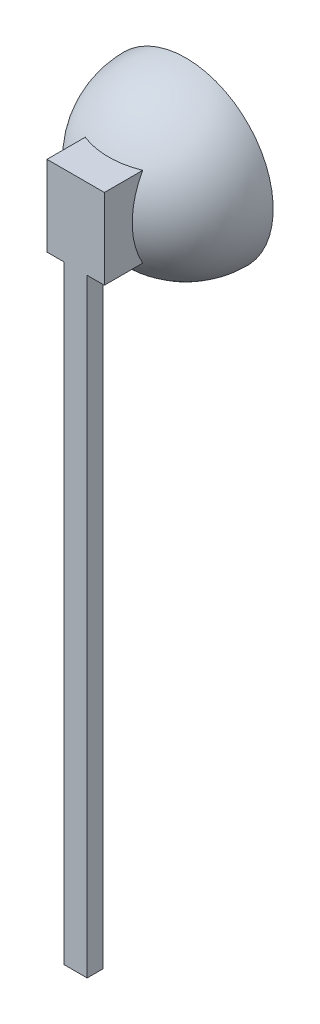
ISO-10303-21;
HEADER;
FILE_DESCRIPTION(('STEP AP214'),'2;1');
FILE_NAME('part.step','',(''),(''),'','','');
FILE_SCHEMA(('AUTOMOTIVE_DESIGN { 1 0 10303 214 1 1 1 1 }'));
ENDSEC;
DATA;
#1=APPLICATION_CONTEXT('core data for automotive mechanical design processes');
#2=APPLICATION_PROTOCOL_DEFINITION('international standard','automotive_design',2000,#1);
#3=PRODUCT_CONTEXT('',#1,'mechanical');
#4=PRODUCT('Part','Part','',(#3));
#5=PRODUCT_RELATED_PRODUCT_CATEGORY('part','',(#4));
#6=PRODUCT_DEFINITION_FORMATION('','',#4);
#7=PRODUCT_DEFINITION_CONTEXT('part definition',#1,'design');
#8=PRODUCT_DEFINITION('design','',#6,#7);
#9=PRODUCT_DEFINITION_SHAPE('','',#8);
#10=(LENGTH_UNIT() NAMED_UNIT(*) SI_UNIT(.MILLI.,.METRE.));
#11=(NAMED_UNIT(*) PLANE_ANGLE_UNIT() SI_UNIT($,.RADIAN.));
#12=(NAMED_UNIT(*) SI_UNIT($,.STERADIAN.) SOLID_ANGLE_UNIT());
#13=UNCERTAINTY_MEASURE_WITH_UNIT(LENGTH_MEASURE(1.E-05),#10,'distance_accuracy_value','');
#14=(GEOMETRIC_REPRESENTATION_CONTEXT(3) GLOBAL_UNCERTAINTY_ASSIGNED_CONTEXT((#13)) GLOBAL_UNIT_ASSIGNED_CONTEXT((#10,
#11,#12)) REPRESENTATION_CONTEXT('',''));
#15=CARTESIAN_POINT('',(0.,0.,0.));
#16=DIRECTION('',(0.,0.,1.));
#17=DIRECTION('',(1.,0.,0.));
#18=AXIS2_PLACEMENT_3D('',#15,#16,#17);
#19=CARTESIAN_POINT('',(0.,0.,0.));
#20=DIRECTION('',(0.,1.,0.));
#21=DIRECTION('',(1.,0.,0.));
#22=AXIS2_PLACEMENT_3D('',#19,#20,#21);
#23=SPHERICAL_SURFACE('',#22,33.);
#24=CARTESIAN_POINT('',(0.,0.,0.));
#25=DIRECTION('',(0.,0.,1.));
#26=DIRECTION('',(-1.,0.,0.));
#27=AXIS2_PLACEMENT_3D('',#24,#25,#26);
#28=SPHERICAL_SURFACE('',#27,33.);
#29=CARTESIAN_POINT('',(0.,0.,0.));
#30=DIRECTION('',(0.,0.,1.));
#31=DIRECTION('',(-1.,0.,0.));
#32=AXIS2_PLACEMENT_3D('',#29,#30,#31);
#33=CIRCLE('',#32,33.);
#34=CARTESIAN_POINT('',(-33.,0.,-2.30437768363647E-13));
#35=VERTEX_POINT('',#34);
#36=EDGE_CURVE('E46',#35,#35,#33,.T.);
#37=ORIENTED_EDGE('',*,*,#36,.F.);
#38=EDGE_LOOP('',(#37));
#39=FACE_BOUND('',#38,.T.);
#40=ADVANCED_FACE('F38',(#39),#28,.F.);
#41=CARTESIAN_POINT('',(0.,0.,0.));
#42=DIRECTION('',(0.,1.,0.));
#43=DIRECTION('',(1.,0.,0.));
#44=AXIS2_PLACEMENT_3D('',#41,#42,#43);
#45=SPHERICAL_SURFACE('',#44,38.);
#46=CARTESIAN_POINT('',(0.,-17.5,0.));
#47=DIRECTION('',(0.,1.,0.));
#48=DIRECTION('',(0.,0.,1.));
#49=AXIS2_PLACEMENT_3D('',#46,#47,#48);
#50=CIRCLE('',#49,33.7305499510459);
#51=CARTESIAN_POINT('',(12.4999999999998,-17.5,31.3289003956412));
#52=VERTEX_POINT('',#51);
#53=CARTESIAN_POINT('',(-12.5000000000002,-17.5,31.328900395641));
#54=VERTEX_POINT('',#53);
#55=EDGE_CURVE('E194',#52,#54,#50,.F.);
#56=ORIENTED_EDGE('',*,*,#55,.T.);
#57=CARTESIAN_POINT('',(-12.5,0.,0.));
#58=DIRECTION('',(1.,0.,0.));
#59=DIRECTION('',(0.,0.,-1.));
#60=AXIS2_PLACEMENT_3D('',#57,#58,#59);
#61=CIRCLE('',#60,35.8852337319962);
#62=CARTESIAN_POINT('',(-12.5000000000002,17.5,31.328900395641));
#63=VERTEX_POINT('',#62);
#64=EDGE_CURVE('E193',#54,#63,#61,.F.);
#65=ORIENTED_EDGE('',*,*,#64,.T.);
#66=CARTESIAN_POINT('',(0.,17.5,0.));
#67=DIRECTION('',(0.,-1.,0.));
#68=DIRECTION('',(0.,0.,-1.));
#69=AXIS2_PLACEMENT_3D('',#66,#67,#68);
#70=CIRCLE('',#69,33.7305499510459);
#71=CARTESIAN_POINT('',(12.4999999999998,17.5,31.3289003956412));
#72=VERTEX_POINT('',#71);
#73=EDGE_CURVE('E201',#63,#72,#70,.F.);
#74=ORIENTED_EDGE('',*,*,#73,.T.);
#75=CARTESIAN_POINT('',(12.5,0.,0.));
#76=DIRECTION('',(-1.,0.,0.));
#77=DIRECTION('',(0.,0.,1.));
#78=AXIS2_PLACEMENT_3D('',#75,#76,#77);
#79=CIRCLE('',#78,35.8852337319962);
#80=EDGE_CURVE('E198',#72,#52,#79,.F.);
#81=ORIENTED_EDGE('',*,*,#80,.T.);
#82=EDGE_LOOP('',(#56,#65,#74,#81));
#83=FACE_BOUND('',#82,.T.);
#84=CARTESIAN_POINT('',(0.,0.,0.));
#85=DIRECTION('',(0.,0.,-1.));
#86=DIRECTION('',(-1.,0.,0.));
#87=AXIS2_PLACEMENT_3D('',#84,#85,#86);
#88=CIRCLE('',#87,38.);
#89=CARTESIAN_POINT('',(-38.,0.,-2.65352581752078E-13));
#90=VERTEX_POINT('',#89);
#91=EDGE_CURVE('E11',#90,#90,#88,.T.);
#92=ORIENTED_EDGE('',*,*,#91,.F.);
#93=EDGE_LOOP('',(#92));
#94=FACE_BOUND('',#93,.T.);
#95=ADVANCED_FACE('F40',(#83,#94),#45,.T.);
#96=CARTESIAN_POINT('',(0.,0.,0.));
#97=DIRECTION('',(0.,0.,-1.));
#98=DIRECTION('',(-1.,0.,0.));
#99=AXIS2_PLACEMENT_3D('',#96,#97,#98);
#100=PLANE('',#99);
#101=ORIENTED_EDGE('',*,*,#91,.T.);
#102=EDGE_LOOP('',(#101));
#103=FACE_BOUND('',#102,.T.);
#104=ORIENTED_EDGE('',*,*,#36,.T.);
#105=EDGE_LOOP('',(#104));
#106=FACE_BOUND('',#105,.T.);
#107=ADVANCED_FACE('F227',(#103,#106),#100,.T.);
#108=CARTESIAN_POINT('',(-12.5000000000003,-17.5,47.9999999999999));
#109=DIRECTION('',(-1.,0.,0.));
#110=DIRECTION('',(0.,0.,1.));
#111=AXIS2_PLACEMENT_3D('',#108,#109,#110);
#112=PLANE('',#111);
#113=DIRECTION('',(0.,0.,-1.));
#114=VECTOR('',#113,1.);
#115=CARTESIAN_POINT('',(-12.5000000000003,17.5,47.9999999999999));
#116=LINE('',#115,#114);
#117=CARTESIAN_POINT('',(-12.5000000000003,17.5,47.9999999999999));
#118=VERTEX_POINT('',#117);
#119=EDGE_CURVE('E216',#118,#63,#116,.T.);
#120=ORIENTED_EDGE('',*,*,#119,.T.);
#121=ORIENTED_EDGE('',*,*,#64,.F.);
#122=DIRECTION('',(0.,0.,-1.));
#123=VECTOR('',#122,1.);
#124=CARTESIAN_POINT('',(-12.5000000000003,-17.5,47.9999999999999));
#125=LINE('',#124,#123);
#126=CARTESIAN_POINT('',(-12.5000000000003,-17.5,47.9999999999999));
#127=VERTEX_POINT('',#126);
#128=EDGE_CURVE('E217',#127,#54,#125,.T.);
#129=ORIENTED_EDGE('',*,*,#128,.F.);
#130=DIRECTION('',(0.,1.,0.));
#131=VECTOR('',#130,1.);
#132=CARTESIAN_POINT('',(-12.5000000000003,-17.5,47.9999999999999));
#133=LINE('',#132,#131);
#134=EDGE_CURVE('E197',#127,#118,#133,.T.);
#135=ORIENTED_EDGE('',*,*,#134,.T.);
#136=EDGE_LOOP('',(#120,#121,#129,#135));
#137=FACE_BOUND('',#136,.T.);
#138=ADVANCED_FACE('F237',(#137),#112,.T.);
#139=CARTESIAN_POINT('',(12.4999999999997,-17.5,48.0000000000001));
#140=DIRECTION('',(0.,-1.,0.));
#141=DIRECTION('',(0.,0.,-1.));
#142=AXIS2_PLACEMENT_3D('',#139,#140,#141);
#143=PLANE('',#142);
#144=DIRECTION('',(0.,0.,-1.));
#145=VECTOR('',#144,1.);
#146=CARTESIAN_POINT('',(-5.00000000000034,-17.5,48.0000000000001));
#147=LINE('',#146,#145);
#148=CARTESIAN_POINT('',(-5.00000000000034,-17.5,48.));
#149=VERTEX_POINT('',#148);
#150=CARTESIAN_POINT('',(-5.00000000000034,-17.5,41.));
#151=VERTEX_POINT('',#150);
#152=EDGE_CURVE('E190',#149,#151,#147,.T.);
#153=ORIENTED_EDGE('',*,*,#152,.F.);
#154=DIRECTION('',(-1.,0.,0.));
#155=VECTOR('',#154,1.);
#156=CARTESIAN_POINT('',(12.4999999999997,-17.5,48.0000000000001));
#157=LINE('',#156,#155);
#158=EDGE_CURVE('E213',#149,#127,#157,.T.);
#159=ORIENTED_EDGE('',*,*,#158,.T.);
#160=ORIENTED_EDGE('',*,*,#128,.T.);
#161=ORIENTED_EDGE('',*,*,#55,.F.);
#162=DIRECTION('',(0.,0.,-1.));
#163=VECTOR('',#162,1.);
#164=CARTESIAN_POINT('',(12.4999999999997,-17.5,48.0000000000001));
#165=LINE('',#164,#163);
#166=CARTESIAN_POINT('',(12.4999999999997,-17.5,48.0000000000001));
#167=VERTEX_POINT('',#166);
#168=EDGE_CURVE('E219',#167,#52,#165,.T.);
#169=ORIENTED_EDGE('',*,*,#168,.F.);
#170=CARTESIAN_POINT('',(4.99999999999966,-17.5,48.));
#171=VERTEX_POINT('',#170);
#172=EDGE_CURVE('E214',#167,#171,#157,.T.);
#173=ORIENTED_EDGE('',*,*,#172,.T.);
#174=DIRECTION('',(0.,0.,1.));
#175=VECTOR('',#174,1.);
#176=CARTESIAN_POINT('',(4.99999999999966,-17.5,48.0000000000001));
#177=LINE('',#176,#175);
#178=CARTESIAN_POINT('',(4.99999999999969,-17.5,41.));
#179=VERTEX_POINT('',#178);
#180=EDGE_CURVE('E185',#179,#171,#177,.T.);
#181=ORIENTED_EDGE('',*,*,#180,.F.);
#182=DIRECTION('',(-1.,0.,0.));
#183=VECTOR('',#182,1.);
#184=CARTESIAN_POINT('',(12.4999999999997,-17.5,41.));
#185=LINE('',#184,#183);
#186=EDGE_CURVE('E61',#179,#151,#185,.T.);
#187=ORIENTED_EDGE('',*,*,#186,.T.);
#188=EDGE_LOOP('',(#153,#159,#160,#161,#169,#173,#181,#187));
#189=FACE_BOUND('',#188,.T.);
#190=ADVANCED_FACE('F241',(#189),#143,.T.);
#191=CARTESIAN_POINT('',(12.4999999999997,-17.5,48.0000000000001));
#192=DIRECTION('',(1.,0.,0.));
#193=DIRECTION('',(0.,0.,-1.));
#194=AXIS2_PLACEMENT_3D('',#191,#192,#193);
#195=PLANE('',#194);
#196=ORIENTED_EDGE('',*,*,#168,.T.);
#197=ORIENTED_EDGE('',*,*,#80,.F.);
#198=DIRECTION('',(0.,0.,-1.));
#199=VECTOR('',#198,1.);
#200=CARTESIAN_POINT('',(12.4999999999997,17.5,48.0000000000001));
#201=LINE('',#200,#199);
#202=CARTESIAN_POINT('',(12.4999999999997,17.5,48.0000000000001));
#203=VERTEX_POINT('',#202);
#204=EDGE_CURVE('E221',#203,#72,#201,.T.);
#205=ORIENTED_EDGE('',*,*,#204,.F.);
#206=DIRECTION('',(0.,-1.,0.));
#207=VECTOR('',#206,1.);
#208=CARTESIAN_POINT('',(12.4999999999997,-17.5,48.0000000000001));
#209=LINE('',#208,#207);
#210=EDGE_CURVE('E210',#203,#167,#209,.T.);
#211=ORIENTED_EDGE('',*,*,#210,.T.);
#212=EDGE_LOOP('',(#196,#197,#205,#211));
#213=FACE_BOUND('',#212,.T.);
#214=ADVANCED_FACE('F247',(#213),#195,.T.);
#215=CARTESIAN_POINT('',(12.4999999999997,17.5,48.0000000000001));
#216=DIRECTION('',(0.,1.,0.));
#217=DIRECTION('',(0.,0.,1.));
#218=AXIS2_PLACEMENT_3D('',#215,#216,#217);
#219=PLANE('',#218);
#220=DIRECTION('',(1.,0.,0.));
#221=VECTOR('',#220,1.);
#222=CARTESIAN_POINT('',(12.4999999999997,17.5,48.0000000000001));
#223=LINE('',#222,#221);
#224=EDGE_CURVE('E208',#118,#203,#223,.T.);
#225=ORIENTED_EDGE('',*,*,#224,.T.);
#226=ORIENTED_EDGE('',*,*,#204,.T.);
#227=ORIENTED_EDGE('',*,*,#73,.F.);
#228=ORIENTED_EDGE('',*,*,#119,.F.);
#229=EDGE_LOOP('',(#225,#226,#227,#228));
#230=FACE_BOUND('',#229,.T.);
#231=ADVANCED_FACE('F243',(#230),#219,.T.);
#232=CARTESIAN_POINT('',(-3.44054713859276E-13,0.,48.));
#233=DIRECTION('',(0.,0.,1.));
#234=DIRECTION('',(1.,0.,0.));
#235=AXIS2_PLACEMENT_3D('',#232,#233,#234);
#236=PLANE('',#235);
#237=ORIENTED_EDGE('',*,*,#210,.F.);
#238=ORIENTED_EDGE('',*,*,#224,.F.);
#239=ORIENTED_EDGE('',*,*,#134,.F.);
#240=ORIENTED_EDGE('',*,*,#158,.F.);
#241=DIRECTION('',(0.,-1.,0.));
#242=VECTOR('',#241,1.);
#243=CARTESIAN_POINT('',(-5.00000000000035,17.5,48.));
#244=LINE('',#243,#242);
#245=CARTESIAN_POINT('',(-5.00000000000031,-282.5,48.));
#246=VERTEX_POINT('',#245);
#247=EDGE_CURVE('E163',#149,#246,#244,.T.);
#248=ORIENTED_EDGE('',*,*,#247,.T.);
#249=DIRECTION('',(1.,0.,0.));
#250=VECTOR('',#249,1.);
#251=CARTESIAN_POINT('',(-5.00000000000031,-282.5,48.));
#252=LINE('',#251,#250);
#253=CARTESIAN_POINT('',(4.99999999999969,-282.5,48.));
#254=VERTEX_POINT('',#253);
#255=EDGE_CURVE('E178',#246,#254,#252,.T.);
#256=ORIENTED_EDGE('',*,*,#255,.T.);
#257=DIRECTION('',(0.,1.,0.));
#258=VECTOR('',#257,1.);
#259=CARTESIAN_POINT('',(4.99999999999965,17.5,48.));
#260=LINE('',#259,#258);
#261=EDGE_CURVE('E170',#254,#171,#260,.T.);
#262=ORIENTED_EDGE('',*,*,#261,.T.);
#263=ORIENTED_EDGE('',*,*,#172,.F.);
#264=EDGE_LOOP('',(#237,#238,#239,#240,#248,#256,#262,#263));
#265=FACE_BOUND('',#264,.T.);
#266=ADVANCED_FACE('F246',(#265),#236,.T.);
#267=CARTESIAN_POINT('',(-5.00000000000035,17.5,41.));
#268=DIRECTION('',(-1.,0.,0.));
#269=DIRECTION('',(0.,-1.,0.));
#270=AXIS2_PLACEMENT_3D('',#267,#268,#269);
#271=PLANE('',#270);
#272=ORIENTED_EDGE('',*,*,#247,.F.);
#273=ORIENTED_EDGE('',*,*,#152,.T.);
#274=DIRECTION('',(0.,-1.,0.));
#275=VECTOR('',#274,1.);
#276=CARTESIAN_POINT('',(-5.00000000000035,17.5,41.));
#277=LINE('',#276,#275);
#278=CARTESIAN_POINT('',(-5.00000000000031,-282.5,41.));
#279=VERTEX_POINT('',#278);
#280=EDGE_CURVE('E167',#151,#279,#277,.T.);
#281=ORIENTED_EDGE('',*,*,#280,.T.);
#282=DIRECTION('',(0.,0.,1.));
#283=VECTOR('',#282,1.);
#284=CARTESIAN_POINT('',(-5.00000000000031,-282.5,41.));
#285=LINE('',#284,#283);
#286=EDGE_CURVE('E176',#279,#246,#285,.T.);
#287=ORIENTED_EDGE('',*,*,#286,.T.);
#288=EDGE_LOOP('',(#272,#273,#281,#287));
#289=FACE_BOUND('',#288,.T.);
#290=ADVANCED_FACE('F256',(#289),#271,.T.);
#291=CARTESIAN_POINT('',(4.99999999999965,17.5,41.));
#292=DIRECTION('',(1.,0.,0.));
#293=DIRECTION('',(0.,1.,0.));
#294=AXIS2_PLACEMENT_3D('',#291,#292,#293);
#295=PLANE('',#294);
#296=DIRECTION('',(0.,1.,0.));
#297=VECTOR('',#296,1.);
#298=CARTESIAN_POINT('',(4.99999999999965,17.5,41.));
#299=LINE('',#298,#297);
#300=CARTESIAN_POINT('',(4.99999999999969,-282.5,41.));
#301=VERTEX_POINT('',#300);
#302=EDGE_CURVE('E173',#301,#179,#299,.T.);
#303=ORIENTED_EDGE('',*,*,#302,.T.);
#304=ORIENTED_EDGE('',*,*,#180,.T.);
#305=ORIENTED_EDGE('',*,*,#261,.F.);
#306=DIRECTION('',(0.,0.,1.));
#307=VECTOR('',#306,1.);
#308=CARTESIAN_POINT('',(4.99999999999969,-282.5,41.));
#309=LINE('',#308,#307);
#310=EDGE_CURVE('E183',#301,#254,#309,.T.);
#311=ORIENTED_EDGE('',*,*,#310,.F.);
#312=EDGE_LOOP('',(#303,#304,#305,#311));
#313=FACE_BOUND('',#312,.T.);
#314=ADVANCED_FACE('F260',(#313),#295,.T.);
#315=CARTESIAN_POINT('',(-5.00000000000031,-282.5,41.));
#316=DIRECTION('',(0.,-1.,0.));
#317=DIRECTION('',(0.,0.,-1.));
#318=AXIS2_PLACEMENT_3D('',#315,#316,#317);
#319=PLANE('',#318);
#320=DIRECTION('',(0.,0.,1.));
#321=VECTOR('',#320,1.);
#322=CARTESIAN_POINT('',(3.49999999999969,-282.5,42.25));
#323=LINE('',#322,#321);
#324=CARTESIAN_POINT('',(3.49999999999969,-282.5,42.25));
#325=VERTEX_POINT('',#324);
#326=CARTESIAN_POINT('',(3.49999999999969,-282.5,46.75));
#327=VERTEX_POINT('',#326);
#328=EDGE_CURVE('E53',#325,#327,#323,.T.);
#329=ORIENTED_EDGE('',*,*,#328,.F.);
#330=DIRECTION('',(1.,0.,0.));
#331=VECTOR('',#330,1.);
#332=CARTESIAN_POINT('',(3.49999999999969,-282.5,42.25));
#333=LINE('',#332,#331);
#334=CARTESIAN_POINT('',(-3.50000000000031,-282.5,42.25));
#335=VERTEX_POINT('',#334);
#336=EDGE_CURVE('E148',#335,#325,#333,.T.);
#337=ORIENTED_EDGE('',*,*,#336,.F.);
#338=DIRECTION('',(0.,0.,-1.));
#339=VECTOR('',#338,1.);
#340=CARTESIAN_POINT('',(-3.50000000000031,-282.5,42.25));
#341=LINE('',#340,#339);
#342=CARTESIAN_POINT('',(-3.50000000000031,-282.5,46.75));
#343=VERTEX_POINT('',#342);
#344=EDGE_CURVE('E151',#343,#335,#341,.T.);
#345=ORIENTED_EDGE('',*,*,#344,.F.);
#346=DIRECTION('',(-1.,0.,0.));
#347=VECTOR('',#346,1.);
#348=CARTESIAN_POINT('',(3.49999999999969,-282.5,46.75));
#349=LINE('',#348,#347);
#350=EDGE_CURVE('E157',#327,#343,#349,.T.);
#351=ORIENTED_EDGE('',*,*,#350,.F.);
#352=EDGE_LOOP('',(#329,#337,#345,#351));
#353=FACE_BOUND('',#352,.T.);
#354=ORIENTED_EDGE('',*,*,#255,.F.);
#355=ORIENTED_EDGE('',*,*,#286,.F.);
#356=DIRECTION('',(1.,0.,0.));
#357=VECTOR('',#356,1.);
#358=CARTESIAN_POINT('',(-5.00000000000031,-282.5,41.));
#359=LINE('',#358,#357);
#360=EDGE_CURVE('E169',#279,#301,#359,.T.);
#361=ORIENTED_EDGE('',*,*,#360,.T.);
#362=ORIENTED_EDGE('',*,*,#310,.T.);
#363=EDGE_LOOP('',(#354,#355,#361,#362));
#364=FACE_BOUND('',#363,.T.);
#365=ADVANCED_FACE('F262',(#353,#364),#319,.T.);
#366=CARTESIAN_POINT('',(0.,0.,41.));
#367=DIRECTION('',(0.,0.,1.));
#368=DIRECTION('',(1.,0.,0.));
#369=AXIS2_PLACEMENT_3D('',#366,#367,#368);
#370=PLANE('',#369);
#371=ORIENTED_EDGE('',*,*,#186,.F.);
#372=ORIENTED_EDGE('',*,*,#302,.F.);
#373=ORIENTED_EDGE('',*,*,#360,.F.);
#374=ORIENTED_EDGE('',*,*,#280,.F.);
#375=EDGE_LOOP('',(#371,#372,#373,#374));
#376=FACE_BOUND('',#375,.T.);
#377=ADVANCED_FACE('F265',(#376),#370,.F.);
#378=CARTESIAN_POINT('',(3.49999999999969,-17.5,42.25));
#379=DIRECTION('',(1.,0.,0.));
#380=DIRECTION('',(0.,0.,-1.));
#381=AXIS2_PLACEMENT_3D('',#378,#379,#380);
#382=PLANE('',#381);
#383=ORIENTED_EDGE('',*,*,#328,.T.);
#384=DIRECTION('',(0.,-1.,0.));
#385=VECTOR('',#384,1.);
#386=CARTESIAN_POINT('',(3.49999999999969,-17.5,46.75));
#387=LINE('',#386,#385);
#388=CARTESIAN_POINT('',(3.49999999999969,-17.5,46.75));
#389=VERTEX_POINT('',#388);
#390=EDGE_CURVE('E126',#389,#327,#387,.T.);
#391=ORIENTED_EDGE('',*,*,#390,.F.);
#392=DIRECTION('',(0.,0.,1.));
#393=VECTOR('',#392,1.);
#394=CARTESIAN_POINT('',(3.49999999999969,-17.5,42.25));
#395=LINE('',#394,#393);
#396=CARTESIAN_POINT('',(3.49999999999969,-17.5,42.25));
#397=VERTEX_POINT('',#396);
#398=EDGE_CURVE('E130',#397,#389,#395,.T.);
#399=ORIENTED_EDGE('',*,*,#398,.F.);
#400=DIRECTION('',(0.,-1.,0.));
#401=VECTOR('',#400,1.);
#402=CARTESIAN_POINT('',(3.49999999999969,-17.5,42.25));
#403=LINE('',#402,#401);
#404=EDGE_CURVE('E161',#397,#325,#403,.T.);
#405=ORIENTED_EDGE('',*,*,#404,.T.);
#406=EDGE_LOOP('',(#383,#391,#399,#405));
#407=FACE_BOUND('',#406,.T.);
#408=ADVANCED_FACE('F128',(#407),#382,.F.);
#409=CARTESIAN_POINT('',(3.49999999999969,-17.5,42.25));
#410=DIRECTION('',(0.,0.,-1.));
#411=DIRECTION('',(-1.,0.,0.));
#412=AXIS2_PLACEMENT_3D('',#409,#410,#411);
#413=PLANE('',#412);
#414=ORIENTED_EDGE('',*,*,#336,.T.);
#415=ORIENTED_EDGE('',*,*,#404,.F.);
#416=DIRECTION('',(1.,0.,0.));
#417=VECTOR('',#416,1.);
#418=CARTESIAN_POINT('',(3.49999999999969,-17.5,42.25));
#419=LINE('',#418,#417);
#420=CARTESIAN_POINT('',(-3.50000000000031,-17.5,42.25));
#421=VERTEX_POINT('',#420);
#422=EDGE_CURVE('E136',#421,#397,#419,.T.);
#423=ORIENTED_EDGE('',*,*,#422,.F.);
#424=DIRECTION('',(0.,-1.,0.));
#425=VECTOR('',#424,1.);
#426=CARTESIAN_POINT('',(-3.50000000000031,-17.5,42.25));
#427=LINE('',#426,#425);
#428=EDGE_CURVE('E164',#421,#335,#427,.T.);
#429=ORIENTED_EDGE('',*,*,#428,.T.);
#430=EDGE_LOOP('',(#414,#415,#423,#429));
#431=FACE_BOUND('',#430,.T.);
#432=ADVANCED_FACE('F275',(#431),#413,.F.);
#433=CARTESIAN_POINT('',(-3.50000000000031,-17.5,42.25));
#434=DIRECTION('',(-1.,0.,0.));
#435=DIRECTION('',(0.,0.,1.));
#436=AXIS2_PLACEMENT_3D('',#433,#434,#435);
#437=PLANE('',#436);
#438=ORIENTED_EDGE('',*,*,#344,.T.);
#439=ORIENTED_EDGE('',*,*,#428,.F.);
#440=DIRECTION('',(0.,0.,-1.));
#441=VECTOR('',#440,1.);
#442=CARTESIAN_POINT('',(-3.50000000000031,-17.5,42.25));
#443=LINE('',#442,#441);
#444=CARTESIAN_POINT('',(-3.50000000000031,-17.5,46.75));
#445=VERTEX_POINT('',#444);
#446=EDGE_CURVE('E144',#445,#421,#443,.T.);
#447=ORIENTED_EDGE('',*,*,#446,.F.);
#448=DIRECTION('',(0.,-1.,0.));
#449=VECTOR('',#448,1.);
#450=CARTESIAN_POINT('',(-3.50000000000031,-17.5,46.75));
#451=LINE('',#450,#449);
#452=EDGE_CURVE('E135',#445,#343,#451,.T.);
#453=ORIENTED_EDGE('',*,*,#452,.T.);
#454=EDGE_LOOP('',(#438,#439,#447,#453));
#455=FACE_BOUND('',#454,.T.);
#456=ADVANCED_FACE('F278',(#455),#437,.F.);
#457=CARTESIAN_POINT('',(3.49999999999969,-17.5,46.75));
#458=DIRECTION('',(0.,0.,1.));
#459=DIRECTION('',(1.,0.,0.));
#460=AXIS2_PLACEMENT_3D('',#457,#458,#459);
#461=PLANE('',#460);
#462=ORIENTED_EDGE('',*,*,#350,.T.);
#463=ORIENTED_EDGE('',*,*,#452,.F.);
#464=DIRECTION('',(-1.,0.,0.));
#465=VECTOR('',#464,1.);
#466=CARTESIAN_POINT('',(3.49999999999969,-17.5,46.75));
#467=LINE('',#466,#465);
#468=EDGE_CURVE('E139',#389,#445,#467,.T.);
#469=ORIENTED_EDGE('',*,*,#468,.F.);
#470=ORIENTED_EDGE('',*,*,#390,.T.);
#471=EDGE_LOOP('',(#462,#463,#469,#470));
#472=FACE_BOUND('',#471,.T.);
#473=ADVANCED_FACE('F140',(#472),#461,.F.);
#474=CARTESIAN_POINT('',(0.,-17.5,0.));
#475=DIRECTION('',(0.,-1.,0.));
#476=DIRECTION('',(0.,0.,-1.));
#477=AXIS2_PLACEMENT_3D('',#474,#475,#476);
#478=PLANE('',#477);
#479=ORIENTED_EDGE('',*,*,#398,.T.);
#480=ORIENTED_EDGE('',*,*,#468,.T.);
#481=ORIENTED_EDGE('',*,*,#446,.T.);
#482=ORIENTED_EDGE('',*,*,#422,.T.);
#483=EDGE_LOOP('',(#479,#480,#481,#482));
#484=FACE_BOUND('',#483,.T.);
#485=ADVANCED_FACE('F146',(#484),#478,.T.);
#486=CLOSED_SHELL('',(#40,#95,#107,#138,#190,#214,#231,#266,#290,#314,#365,#377,#408,#432,#456,
#473,#485));
#487=MANIFOLD_SOLID_BREP('B2',#486);
#488=ADVANCED_BREP_SHAPE_REPRESENTATION('',(#18,#487),#14);
#489=SHAPE_DEFINITION_REPRESENTATION(#9,#488);
ENDSEC;
END-ISO-10303-21;
